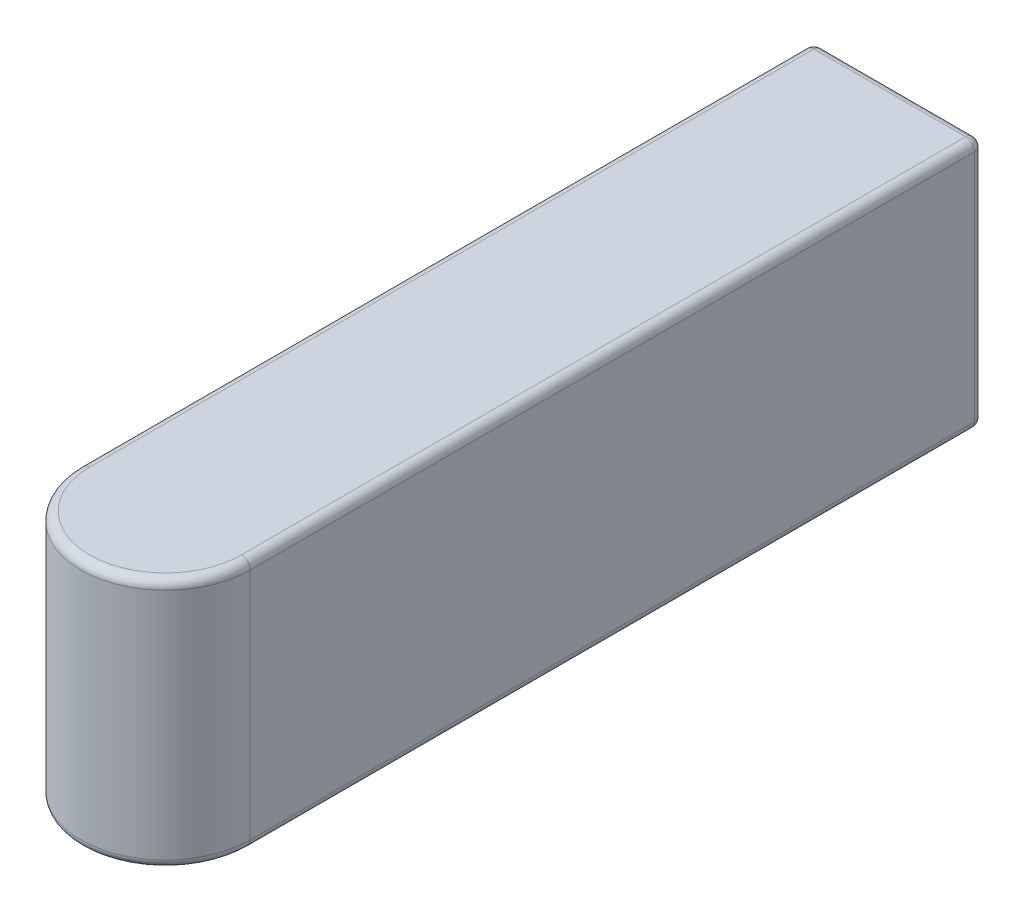
ISO-10303-21;
HEADER;
FILE_DESCRIPTION(('STEP AP214'),'2;1');
FILE_NAME('part.step','',(''),(''),'','','');
FILE_SCHEMA(('AUTOMOTIVE_DESIGN { 1 0 10303 214 1 1 1 1 }'));
ENDSEC;
DATA;
#1=APPLICATION_CONTEXT('core data for automotive mechanical design processes');
#2=APPLICATION_PROTOCOL_DEFINITION('international standard','automotive_design',2000,#1);
#3=PRODUCT_CONTEXT('',#1,'mechanical');
#4=PRODUCT('Part','Part','',(#3));
#5=PRODUCT_RELATED_PRODUCT_CATEGORY('part','',(#4));
#6=PRODUCT_DEFINITION_FORMATION('','',#4);
#7=PRODUCT_DEFINITION_CONTEXT('part definition',#1,'design');
#8=PRODUCT_DEFINITION('design','',#6,#7);
#9=PRODUCT_DEFINITION_SHAPE('','',#8);
#10=(LENGTH_UNIT() NAMED_UNIT(*) SI_UNIT(.MILLI.,.METRE.));
#11=(NAMED_UNIT(*) PLANE_ANGLE_UNIT() SI_UNIT($,.RADIAN.));
#12=(NAMED_UNIT(*) SI_UNIT($,.STERADIAN.) SOLID_ANGLE_UNIT());
#13=UNCERTAINTY_MEASURE_WITH_UNIT(LENGTH_MEASURE(1.E-05),#10,'distance_accuracy_value','');
#14=(GEOMETRIC_REPRESENTATION_CONTEXT(3) GLOBAL_UNCERTAINTY_ASSIGNED_CONTEXT((#13)) GLOBAL_UNIT_ASSIGNED_CONTEXT((#10,
#11,#12)) REPRESENTATION_CONTEXT('',''));
#15=CARTESIAN_POINT('',(0.,0.,0.));
#16=DIRECTION('',(0.,0.,1.));
#17=DIRECTION('',(1.,0.,0.));
#18=AXIS2_PLACEMENT_3D('',#15,#16,#17);
#19=CARTESIAN_POINT('',(29.,43.,0.));
#20=DIRECTION('',(1.,0.,0.));
#21=DIRECTION('',(0.,0.,-1.));
#22=AXIS2_PLACEMENT_3D('',#19,#20,#21);
#23=PLANE('',#22);
#24=DIRECTION('',(0.,-1.,0.));
#25=VECTOR('',#24,1.);
#26=CARTESIAN_POINT('',(29.,43.,125.5));
#27=LINE('',#26,#25);
#28=CARTESIAN_POINT('',(29.,41.5,125.5));
#29=VERTEX_POINT('',#28);
#30=CARTESIAN_POINT('',(29.,1.5,125.5));
#31=VERTEX_POINT('',#30);
#32=EDGE_CURVE('E122',#29,#31,#27,.T.);
#33=ORIENTED_EDGE('',*,*,#32,.T.);
#34=DIRECTION('',(0.,0.,1.));
#35=VECTOR('',#34,1.);
#36=CARTESIAN_POINT('',(29.,1.5,0.));
#37=LINE('',#36,#35);
#38=CARTESIAN_POINT('',(29.,1.5,1.5));
#39=VERTEX_POINT('',#38);
#40=EDGE_CURVE('E170',#31,#39,#37,.F.);
#41=ORIENTED_EDGE('',*,*,#40,.T.);
#42=DIRECTION('',(0.,-1.,0.));
#43=VECTOR('',#42,1.);
#44=CARTESIAN_POINT('',(29.,43.,1.5));
#45=LINE('',#44,#43);
#46=CARTESIAN_POINT('',(29.,41.5,1.5));
#47=VERTEX_POINT('',#46);
#48=EDGE_CURVE('E166',#39,#47,#45,.F.);
#49=ORIENTED_EDGE('',*,*,#48,.T.);
#50=DIRECTION('',(0.,0.,1.));
#51=VECTOR('',#50,1.);
#52=CARTESIAN_POINT('',(29.,41.5,0.));
#53=LINE('',#52,#51);
#54=EDGE_CURVE('E168',#47,#29,#53,.T.);
#55=ORIENTED_EDGE('',*,*,#54,.T.);
#56=EDGE_LOOP('',(#33,#41,#49,#55));
#57=FACE_BOUND('',#56,.T.);
#58=ADVANCED_FACE('F40',(#57),#23,.T.);
#59=CARTESIAN_POINT('',(0.,43.,0.));
#60=DIRECTION('',(0.,0.,-1.));
#61=DIRECTION('',(-1.,0.,0.));
#62=AXIS2_PLACEMENT_3D('',#59,#60,#61);
#63=PLANE('',#62);
#64=DIRECTION('',(1.,0.,0.));
#65=VECTOR('',#64,1.);
#66=CARTESIAN_POINT('',(0.,41.5,0.));
#67=LINE('',#66,#65);
#68=CARTESIAN_POINT('',(1.5,41.5,0.));
#69=VERTEX_POINT('',#68);
#70=CARTESIAN_POINT('',(27.5,41.5,0.));
#71=VERTEX_POINT('',#70);
#72=EDGE_CURVE('E57',#69,#71,#67,.T.);
#73=ORIENTED_EDGE('',*,*,#72,.T.);
#74=DIRECTION('',(0.,-1.,0.));
#75=VECTOR('',#74,1.);
#76=CARTESIAN_POINT('',(27.5,43.,0.));
#77=LINE('',#76,#75);
#78=CARTESIAN_POINT('',(27.5,1.5,0.));
#79=VERTEX_POINT('',#78);
#80=EDGE_CURVE('E127',#71,#79,#77,.T.);
#81=ORIENTED_EDGE('',*,*,#80,.T.);
#82=DIRECTION('',(1.,0.,0.));
#83=VECTOR('',#82,1.);
#84=CARTESIAN_POINT('',(0.,1.5,0.));
#85=LINE('',#84,#83);
#86=CARTESIAN_POINT('',(1.5,1.5,0.));
#87=VERTEX_POINT('',#86);
#88=EDGE_CURVE('E179',#79,#87,#85,.F.);
#89=ORIENTED_EDGE('',*,*,#88,.T.);
#90=DIRECTION('',(0.,-1.,0.));
#91=VECTOR('',#90,1.);
#92=CARTESIAN_POINT('',(1.5,43.,0.));
#93=LINE('',#92,#91);
#94=EDGE_CURVE('E62',#87,#69,#93,.F.);
#95=ORIENTED_EDGE('',*,*,#94,.T.);
#96=EDGE_LOOP('',(#73,#81,#89,#95));
#97=FACE_BOUND('',#96,.T.);
#98=ADVANCED_FACE('F256',(#97),#63,.T.);
#99=CARTESIAN_POINT('',(0.,43.,0.));
#100=DIRECTION('',(1.,0.,0.));
#101=DIRECTION('',(0.,0.,-1.));
#102=AXIS2_PLACEMENT_3D('',#99,#100,#101);
#103=PLANE('',#102);
#104=DIRECTION('',(0.,-1.,0.));
#105=VECTOR('',#104,1.);
#106=CARTESIAN_POINT('',(0.,0.,1.5));
#107=LINE('',#106,#105);
#108=CARTESIAN_POINT('',(0.,41.5,1.5));
#109=VERTEX_POINT('',#108);
#110=CARTESIAN_POINT('',(0.,1.5,1.5));
#111=VERTEX_POINT('',#110);
#112=EDGE_CURVE('E137',#109,#111,#107,.T.);
#113=ORIENTED_EDGE('',*,*,#112,.T.);
#114=DIRECTION('',(0.,0.,1.));
#115=VECTOR('',#114,1.);
#116=CARTESIAN_POINT('',(0.,1.5,0.));
#117=LINE('',#116,#115);
#118=CARTESIAN_POINT('',(0.,1.5,125.5));
#119=VERTEX_POINT('',#118);
#120=EDGE_CURVE('E136',#111,#119,#117,.T.);
#121=ORIENTED_EDGE('',*,*,#120,.T.);
#122=DIRECTION('',(0.,-1.,0.));
#123=VECTOR('',#122,1.);
#124=CARTESIAN_POINT('',(0.,43.,125.5));
#125=LINE('',#124,#123);
#126=CARTESIAN_POINT('',(0.,41.5,125.5));
#127=VERTEX_POINT('',#126);
#128=EDGE_CURVE('E120',#127,#119,#125,.T.);
#129=ORIENTED_EDGE('',*,*,#128,.F.);
#130=DIRECTION('',(0.,0.,1.));
#131=VECTOR('',#130,1.);
#132=CARTESIAN_POINT('',(0.,41.5,0.));
#133=LINE('',#132,#131);
#134=EDGE_CURVE('E133',#127,#109,#133,.F.);
#135=ORIENTED_EDGE('',*,*,#134,.T.);
#136=EDGE_LOOP('',(#113,#121,#129,#135));
#137=FACE_BOUND('',#136,.T.);
#138=ADVANCED_FACE('F131',(#137),#103,.F.);
#139=CARTESIAN_POINT('',(14.5,43.,125.5));
#140=DIRECTION('',(0.,-1.,0.));
#141=DIRECTION('',(0.,0.,-1.));
#142=AXIS2_PLACEMENT_3D('',#139,#140,#141);
#143=CYLINDRICAL_SURFACE('',#142,14.5);
#144=ORIENTED_EDGE('',*,*,#128,.T.);
#145=CARTESIAN_POINT('',(14.5,1.5,125.5));
#146=DIRECTION('',(0.,1.,0.));
#147=DIRECTION('',(0.,0.,1.));
#148=AXIS2_PLACEMENT_3D('',#145,#146,#147);
#149=CIRCLE('',#148,14.5);
#150=EDGE_CURVE('E11',#119,#31,#149,.T.);
#151=ORIENTED_EDGE('',*,*,#150,.T.);
#152=ORIENTED_EDGE('',*,*,#32,.F.);
#153=CARTESIAN_POINT('',(14.5,41.5,125.5));
#154=DIRECTION('',(0.,1.,0.));
#155=DIRECTION('',(0.,0.,1.));
#156=AXIS2_PLACEMENT_3D('',#153,#154,#155);
#157=CIRCLE('',#156,14.5);
#158=EDGE_CURVE('E49',#29,#127,#157,.F.);
#159=ORIENTED_EDGE('',*,*,#158,.T.);
#160=EDGE_LOOP('',(#144,#151,#152,#159));
#161=FACE_BOUND('',#160,.T.);
#162=ADVANCED_FACE('F119',(#161),#143,.T.);
#163=CARTESIAN_POINT('',(0.,43.,0.));
#164=DIRECTION('',(0.,1.,0.));
#165=DIRECTION('',(0.,0.,1.));
#166=AXIS2_PLACEMENT_3D('',#163,#164,#165);
#167=PLANE('',#166);
#168=DIRECTION('',(0.,0.,1.));
#169=VECTOR('',#168,1.);
#170=CARTESIAN_POINT('',(27.5,43.,0.));
#171=LINE('',#170,#169);
#172=CARTESIAN_POINT('',(27.5,43.,125.5));
#173=VERTEX_POINT('',#172);
#174=CARTESIAN_POINT('',(27.5,43.,1.5));
#175=VERTEX_POINT('',#174);
#176=EDGE_CURVE('E173',#173,#175,#171,.F.);
#177=ORIENTED_EDGE('',*,*,#176,.T.);
#178=DIRECTION('',(1.,0.,0.));
#179=VECTOR('',#178,1.);
#180=CARTESIAN_POINT('',(0.,43.,1.5));
#181=LINE('',#180,#179);
#182=CARTESIAN_POINT('',(1.5,43.,1.5));
#183=VERTEX_POINT('',#182);
#184=EDGE_CURVE('E177',#175,#183,#181,.F.);
#185=ORIENTED_EDGE('',*,*,#184,.T.);
#186=DIRECTION('',(0.,0.,1.));
#187=VECTOR('',#186,1.);
#188=CARTESIAN_POINT('',(1.50000000000002,43.,125.5));
#189=LINE('',#188,#187);
#190=CARTESIAN_POINT('',(1.50000000000001,43.,125.5));
#191=VERTEX_POINT('',#190);
#192=EDGE_CURVE('E175',#183,#191,#189,.T.);
#193=ORIENTED_EDGE('',*,*,#192,.T.);
#194=CARTESIAN_POINT('',(14.5,43.,125.5));
#195=DIRECTION('',(0.,1.,0.));
#196=DIRECTION('',(0.,0.,1.));
#197=AXIS2_PLACEMENT_3D('',#194,#195,#196);
#198=CIRCLE('',#197,13.);
#199=EDGE_CURVE('E142',#191,#173,#198,.T.);
#200=ORIENTED_EDGE('',*,*,#199,.T.);
#201=EDGE_LOOP('',(#177,#185,#193,#200));
#202=FACE_BOUND('',#201,.T.);
#203=ADVANCED_FACE('F419',(#202),#167,.T.);
#204=CARTESIAN_POINT('',(0.,0.,0.));
#205=DIRECTION('',(0.,1.,0.));
#206=DIRECTION('',(0.,0.,1.));
#207=AXIS2_PLACEMENT_3D('',#204,#205,#206);
#208=PLANE('',#207);
#209=DIRECTION('',(0.,0.,1.));
#210=VECTOR('',#209,1.);
#211=CARTESIAN_POINT('',(1.5,0.,0.));
#212=LINE('',#211,#210);
#213=CARTESIAN_POINT('',(1.50000000000001,0.,125.5));
#214=VERTEX_POINT('',#213);
#215=CARTESIAN_POINT('',(1.5,0.,1.5));
#216=VERTEX_POINT('',#215);
#217=EDGE_CURVE('E161',#214,#216,#212,.F.);
#218=ORIENTED_EDGE('',*,*,#217,.T.);
#219=DIRECTION('',(1.,0.,0.));
#220=VECTOR('',#219,1.);
#221=CARTESIAN_POINT('',(29.,0.,1.5));
#222=LINE('',#221,#220);
#223=CARTESIAN_POINT('',(27.5,0.,1.5));
#224=VERTEX_POINT('',#223);
#225=EDGE_CURVE('E164',#216,#224,#222,.T.);
#226=ORIENTED_EDGE('',*,*,#225,.T.);
#227=DIRECTION('',(0.,0.,1.));
#228=VECTOR('',#227,1.);
#229=CARTESIAN_POINT('',(27.5,0.,125.5));
#230=LINE('',#229,#228);
#231=CARTESIAN_POINT('',(27.5,0.,125.5));
#232=VERTEX_POINT('',#231);
#233=EDGE_CURVE('E159',#224,#232,#230,.T.);
#234=ORIENTED_EDGE('',*,*,#233,.T.);
#235=CARTESIAN_POINT('',(14.5,0.,125.5));
#236=DIRECTION('',(0.,1.,0.));
#237=DIRECTION('',(0.,0.,1.));
#238=AXIS2_PLACEMENT_3D('',#235,#236,#237);
#239=CIRCLE('',#238,13.);
#240=EDGE_CURVE('E154',#232,#214,#239,.F.);
#241=ORIENTED_EDGE('',*,*,#240,.T.);
#242=EDGE_LOOP('',(#218,#226,#234,#241));
#243=FACE_BOUND('',#242,.T.);
#244=ADVANCED_FACE('F238',(#243),#208,.F.);
#245=CARTESIAN_POINT('',(27.5,41.5,0.));
#246=DIRECTION('',(0.,0.,1.));
#247=DIRECTION('',(1.,0.,0.));
#248=AXIS2_PLACEMENT_3D('',#245,#246,#247);
#249=CYLINDRICAL_SURFACE('',#248,1.5);
#250=CARTESIAN_POINT('',(27.5,41.5,1.5));
#251=DIRECTION('',(0.,0.,-1.));
#252=DIRECTION('',(-1.,0.,0.));
#253=AXIS2_PLACEMENT_3D('',#250,#251,#252);
#254=CIRCLE('',#253,1.5);
#255=EDGE_CURVE('E215',#175,#47,#254,.T.);
#256=ORIENTED_EDGE('',*,*,#255,.F.);
#257=ORIENTED_EDGE('',*,*,#176,.F.);
#258=CARTESIAN_POINT('',(27.5,41.5,125.5));
#259=DIRECTION('',(0.,0.,1.));
#260=DIRECTION('',(1.,0.,0.));
#261=AXIS2_PLACEMENT_3D('',#258,#259,#260);
#262=CIRCLE('',#261,1.5);
#263=EDGE_CURVE('E44',#29,#173,#262,.T.);
#264=ORIENTED_EDGE('',*,*,#263,.F.);
#265=ORIENTED_EDGE('',*,*,#54,.F.);
#266=EDGE_LOOP('',(#256,#257,#264,#265));
#267=FACE_BOUND('',#266,.T.);
#268=ADVANCED_FACE('F42',(#267),#249,.T.);
#269=CARTESIAN_POINT('',(14.5,41.5,125.5));
#270=DIRECTION('',(0.,1.,0.));
#271=DIRECTION('',(0.,0.,1.));
#272=AXIS2_PLACEMENT_3D('',#269,#270,#271);
#273=TOROIDAL_SURFACE('',#272,13.,1.5);
#274=ORIENTED_EDGE('',*,*,#263,.T.);
#275=ORIENTED_EDGE('',*,*,#199,.F.);
#276=CARTESIAN_POINT('',(1.50000000000001,41.5,125.5));
#277=DIRECTION('',(0.,0.,-1.));
#278=DIRECTION('',(-1.,0.,0.));
#279=AXIS2_PLACEMENT_3D('',#276,#277,#278);
#280=CIRCLE('',#279,1.5);
#281=EDGE_CURVE('E140',#127,#191,#280,.T.);
#282=ORIENTED_EDGE('',*,*,#281,.F.);
#283=ORIENTED_EDGE('',*,*,#158,.F.);
#284=EDGE_LOOP('',(#274,#275,#282,#283));
#285=FACE_BOUND('',#284,.T.);
#286=ADVANCED_FACE('F141',(#285),#273,.T.);
#287=CARTESIAN_POINT('',(27.5,41.5,1.5));
#288=DIRECTION('',(0.,1.,0.));
#289=DIRECTION('',(0.,0.,1.));
#290=AXIS2_PLACEMENT_3D('',#287,#288,#289);
#291=SPHERICAL_SURFACE('',#290,1.5);
#292=CARTESIAN_POINT('',(27.5,41.5,1.5));
#293=DIRECTION('',(0.,1.,0.));
#294=DIRECTION('',(0.,0.,1.));
#295=AXIS2_PLACEMENT_3D('',#292,#293,#294);
#296=CIRCLE('',#295,1.5);
#297=EDGE_CURVE('E147',#71,#47,#296,.F.);
#298=ORIENTED_EDGE('',*,*,#297,.F.);
#299=CARTESIAN_POINT('',(27.5,41.5,1.5));
#300=DIRECTION('',(1.,0.,0.));
#301=DIRECTION('',(0.,0.,-1.));
#302=AXIS2_PLACEMENT_3D('',#299,#300,#301);
#303=CIRCLE('',#302,1.5);
#304=EDGE_CURVE('E146',#175,#71,#303,.F.);
#305=ORIENTED_EDGE('',*,*,#304,.F.);
#306=ORIENTED_EDGE('',*,*,#255,.T.);
#307=EDGE_LOOP('',(#298,#305,#306));
#308=FACE_BOUND('',#307,.T.);
#309=ADVANCED_FACE('F266',(#308),#291,.T.);
#310=CARTESIAN_POINT('',(0.,41.5,1.5));
#311=DIRECTION('',(1.,0.,0.));
#312=DIRECTION('',(0.,0.,-1.));
#313=AXIS2_PLACEMENT_3D('',#310,#311,#312);
#314=CYLINDRICAL_SURFACE('',#313,1.5);
#315=ORIENTED_EDGE('',*,*,#304,.T.);
#316=ORIENTED_EDGE('',*,*,#72,.F.);
#317=CARTESIAN_POINT('',(1.5,41.5,1.5));
#318=DIRECTION('',(-1.,0.,0.));
#319=DIRECTION('',(0.,0.,1.));
#320=AXIS2_PLACEMENT_3D('',#317,#318,#319);
#321=CIRCLE('',#320,1.5);
#322=EDGE_CURVE('E210',#183,#69,#321,.T.);
#323=ORIENTED_EDGE('',*,*,#322,.F.);
#324=ORIENTED_EDGE('',*,*,#184,.F.);
#325=EDGE_LOOP('',(#315,#316,#323,#324));
#326=FACE_BOUND('',#325,.T.);
#327=ADVANCED_FACE('F265',(#326),#314,.T.);
#328=CARTESIAN_POINT('',(1.5,41.5,0.));
#329=DIRECTION('',(0.,0.,-1.));
#330=DIRECTION('',(-1.,0.,0.));
#331=AXIS2_PLACEMENT_3D('',#328,#329,#330);
#332=CYLINDRICAL_SURFACE('',#331,1.5);
#333=ORIENTED_EDGE('',*,*,#281,.T.);
#334=ORIENTED_EDGE('',*,*,#192,.F.);
#335=CARTESIAN_POINT('',(1.5,41.5,1.5));
#336=DIRECTION('',(0.,0.,-1.));
#337=DIRECTION('',(-1.,0.,0.));
#338=AXIS2_PLACEMENT_3D('',#335,#336,#337);
#339=CIRCLE('',#338,1.5);
#340=EDGE_CURVE('E151',#109,#183,#339,.T.);
#341=ORIENTED_EDGE('',*,*,#340,.F.);
#342=ORIENTED_EDGE('',*,*,#134,.F.);
#343=EDGE_LOOP('',(#333,#334,#341,#342));
#344=FACE_BOUND('',#343,.T.);
#345=ADVANCED_FACE('F149',(#344),#332,.T.);
#346=CARTESIAN_POINT('',(27.5,43.,1.5));
#347=DIRECTION('',(0.,-1.,0.));
#348=DIRECTION('',(0.,0.,-1.));
#349=AXIS2_PLACEMENT_3D('',#346,#347,#348);
#350=CYLINDRICAL_SURFACE('',#349,1.5);
#351=ORIENTED_EDGE('',*,*,#297,.T.);
#352=ORIENTED_EDGE('',*,*,#48,.F.);
#353=CARTESIAN_POINT('',(27.5,1.5,1.5));
#354=DIRECTION('',(0.,-1.,0.));
#355=DIRECTION('',(0.,0.,-1.));
#356=AXIS2_PLACEMENT_3D('',#353,#354,#355);
#357=CIRCLE('',#356,1.5);
#358=EDGE_CURVE('E206',#79,#39,#357,.T.);
#359=ORIENTED_EDGE('',*,*,#358,.F.);
#360=ORIENTED_EDGE('',*,*,#80,.F.);
#361=EDGE_LOOP('',(#351,#352,#359,#360));
#362=FACE_BOUND('',#361,.T.);
#363=ADVANCED_FACE('F255',(#362),#350,.T.);
#364=CARTESIAN_POINT('',(1.5,41.5,1.5));
#365=DIRECTION('',(0.,1.,0.));
#366=DIRECTION('',(0.,0.,1.));
#367=AXIS2_PLACEMENT_3D('',#364,#365,#366);
#368=SPHERICAL_SURFACE('',#367,1.5);
#369=ORIENTED_EDGE('',*,*,#340,.T.);
#370=ORIENTED_EDGE('',*,*,#322,.T.);
#371=CARTESIAN_POINT('',(1.5,41.5,1.5));
#372=DIRECTION('',(0.,1.,0.));
#373=DIRECTION('',(0.,0.,1.));
#374=AXIS2_PLACEMENT_3D('',#371,#372,#373);
#375=CIRCLE('',#374,1.5);
#376=EDGE_CURVE('E200',#109,#69,#375,.F.);
#377=ORIENTED_EDGE('',*,*,#376,.F.);
#378=EDGE_LOOP('',(#369,#370,#377));
#379=FACE_BOUND('',#378,.T.);
#380=ADVANCED_FACE('F261',(#379),#368,.T.);
#381=CARTESIAN_POINT('',(27.5,1.5,1.5));
#382=DIRECTION('',(0.,0.,-1.));
#383=DIRECTION('',(-1.,0.,0.));
#384=AXIS2_PLACEMENT_3D('',#381,#382,#383);
#385=SPHERICAL_SURFACE('',#384,1.5);
#386=CARTESIAN_POINT('',(27.5,1.5,1.5));
#387=DIRECTION('',(0.,0.,-1.));
#388=DIRECTION('',(-1.,0.,0.));
#389=AXIS2_PLACEMENT_3D('',#386,#387,#388);
#390=CIRCLE('',#389,1.5);
#391=EDGE_CURVE('E197',#224,#39,#390,.F.);
#392=ORIENTED_EDGE('',*,*,#391,.F.);
#393=CARTESIAN_POINT('',(27.5,1.5,1.5));
#394=DIRECTION('',(1.,0.,0.));
#395=DIRECTION('',(0.,0.,-1.));
#396=AXIS2_PLACEMENT_3D('',#393,#394,#395);
#397=CIRCLE('',#396,1.5);
#398=EDGE_CURVE('E203',#79,#224,#397,.F.);
#399=ORIENTED_EDGE('',*,*,#398,.F.);
#400=ORIENTED_EDGE('',*,*,#358,.T.);
#401=EDGE_LOOP('',(#392,#399,#400));
#402=FACE_BOUND('',#401,.T.);
#403=ADVANCED_FACE('F252',(#402),#385,.T.);
#404=CARTESIAN_POINT('',(0.,1.5,1.5));
#405=DIRECTION('',(-1.,0.,0.));
#406=DIRECTION('',(0.,0.,1.));
#407=AXIS2_PLACEMENT_3D('',#404,#405,#406);
#408=CYLINDRICAL_SURFACE('',#407,1.5);
#409=ORIENTED_EDGE('',*,*,#398,.T.);
#410=ORIENTED_EDGE('',*,*,#225,.F.);
#411=CARTESIAN_POINT('',(1.5,1.5,1.5));
#412=DIRECTION('',(-1.,0.,0.));
#413=DIRECTION('',(0.,0.,1.));
#414=AXIS2_PLACEMENT_3D('',#411,#412,#413);
#415=CIRCLE('',#414,1.5);
#416=EDGE_CURVE('E194',#87,#216,#415,.T.);
#417=ORIENTED_EDGE('',*,*,#416,.F.);
#418=ORIENTED_EDGE('',*,*,#88,.F.);
#419=EDGE_LOOP('',(#409,#410,#417,#418));
#420=FACE_BOUND('',#419,.T.);
#421=ADVANCED_FACE('F248',(#420),#408,.T.);
#422=CARTESIAN_POINT('',(1.5,43.,1.5));
#423=DIRECTION('',(0.,1.,0.));
#424=DIRECTION('',(0.,0.,1.));
#425=AXIS2_PLACEMENT_3D('',#422,#423,#424);
#426=CYLINDRICAL_SURFACE('',#425,1.5);
#427=ORIENTED_EDGE('',*,*,#376,.T.);
#428=ORIENTED_EDGE('',*,*,#94,.F.);
#429=CARTESIAN_POINT('',(1.5,1.5,1.5));
#430=DIRECTION('',(0.,-1.,0.));
#431=DIRECTION('',(0.,0.,-1.));
#432=AXIS2_PLACEMENT_3D('',#429,#430,#431);
#433=CIRCLE('',#432,1.5);
#434=EDGE_CURVE('E191',#111,#87,#433,.T.);
#435=ORIENTED_EDGE('',*,*,#434,.F.);
#436=ORIENTED_EDGE('',*,*,#112,.F.);
#437=EDGE_LOOP('',(#427,#428,#435,#436));
#438=FACE_BOUND('',#437,.T.);
#439=ADVANCED_FACE('F258',(#438),#426,.T.);
#440=CARTESIAN_POINT('',(27.5,1.5,0.));
#441=DIRECTION('',(0.,0.,-1.));
#442=DIRECTION('',(-1.,0.,0.));
#443=AXIS2_PLACEMENT_3D('',#440,#441,#442);
#444=CYLINDRICAL_SURFACE('',#443,1.5);
#445=ORIENTED_EDGE('',*,*,#391,.T.);
#446=ORIENTED_EDGE('',*,*,#40,.F.);
#447=CARTESIAN_POINT('',(27.5,1.5,125.5));
#448=DIRECTION('',(0.,0.,1.));
#449=DIRECTION('',(1.,0.,0.));
#450=AXIS2_PLACEMENT_3D('',#447,#448,#449);
#451=CIRCLE('',#450,1.5);
#452=EDGE_CURVE('E188',#232,#31,#451,.T.);
#453=ORIENTED_EDGE('',*,*,#452,.F.);
#454=ORIENTED_EDGE('',*,*,#233,.F.);
#455=EDGE_LOOP('',(#445,#446,#453,#454));
#456=FACE_BOUND('',#455,.T.);
#457=ADVANCED_FACE('F228',(#456),#444,.T.);
#458=CARTESIAN_POINT('',(1.5,1.5,1.5));
#459=DIRECTION('',(0.,0.,-1.));
#460=DIRECTION('',(-1.,0.,0.));
#461=AXIS2_PLACEMENT_3D('',#458,#459,#460);
#462=SPHERICAL_SURFACE('',#461,1.5);
#463=ORIENTED_EDGE('',*,*,#434,.T.);
#464=ORIENTED_EDGE('',*,*,#416,.T.);
#465=CARTESIAN_POINT('',(1.5,1.5,1.5));
#466=DIRECTION('',(0.,0.,-1.));
#467=DIRECTION('',(-1.,0.,0.));
#468=AXIS2_PLACEMENT_3D('',#465,#466,#467);
#469=CIRCLE('',#468,1.5);
#470=EDGE_CURVE('E186',#111,#216,#469,.F.);
#471=ORIENTED_EDGE('',*,*,#470,.F.);
#472=EDGE_LOOP('',(#463,#464,#471));
#473=FACE_BOUND('',#472,.T.);
#474=ADVANCED_FACE('F245',(#473),#462,.T.);
#475=CARTESIAN_POINT('',(14.5,1.5,125.5));
#476=DIRECTION('',(0.,1.,0.));
#477=DIRECTION('',(0.,0.,1.));
#478=AXIS2_PLACEMENT_3D('',#475,#476,#477);
#479=TOROIDAL_SURFACE('',#478,13.,1.5);
#480=ORIENTED_EDGE('',*,*,#452,.T.);
#481=ORIENTED_EDGE('',*,*,#150,.F.);
#482=CARTESIAN_POINT('',(1.50000000000001,1.5,125.5));
#483=DIRECTION('',(0.,0.,-1.));
#484=DIRECTION('',(-1.,0.,0.));
#485=AXIS2_PLACEMENT_3D('',#482,#483,#484);
#486=CIRCLE('',#485,1.5);
#487=EDGE_CURVE('E184',#214,#119,#486,.T.);
#488=ORIENTED_EDGE('',*,*,#487,.F.);
#489=ORIENTED_EDGE('',*,*,#240,.F.);
#490=EDGE_LOOP('',(#480,#481,#488,#489));
#491=FACE_BOUND('',#490,.T.);
#492=ADVANCED_FACE('F234',(#491),#479,.T.);
#493=CARTESIAN_POINT('',(1.5,1.5,0.));
#494=DIRECTION('',(0.,0.,1.));
#495=DIRECTION('',(1.,0.,0.));
#496=AXIS2_PLACEMENT_3D('',#493,#494,#495);
#497=CYLINDRICAL_SURFACE('',#496,1.5);
#498=ORIENTED_EDGE('',*,*,#470,.T.);
#499=ORIENTED_EDGE('',*,*,#217,.F.);
#500=ORIENTED_EDGE('',*,*,#487,.T.);
#501=ORIENTED_EDGE('',*,*,#120,.F.);
#502=EDGE_LOOP('',(#498,#499,#500,#501));
#503=FACE_BOUND('',#502,.T.);
#504=ADVANCED_FACE('F240',(#503),#497,.T.);
#505=CLOSED_SHELL('',(#58,#98,#138,#162,#203,#244,#268,#286,#309,#327,#345,#363,#380,#403,#421,
#439,#457,#474,#492,#504));
#506=MANIFOLD_SOLID_BREP('B2',#505);
#507=ADVANCED_BREP_SHAPE_REPRESENTATION('',(#18,#506),#14);
#508=SHAPE_DEFINITION_REPRESENTATION(#9,#507);
ENDSEC;
END-ISO-10303-21;
